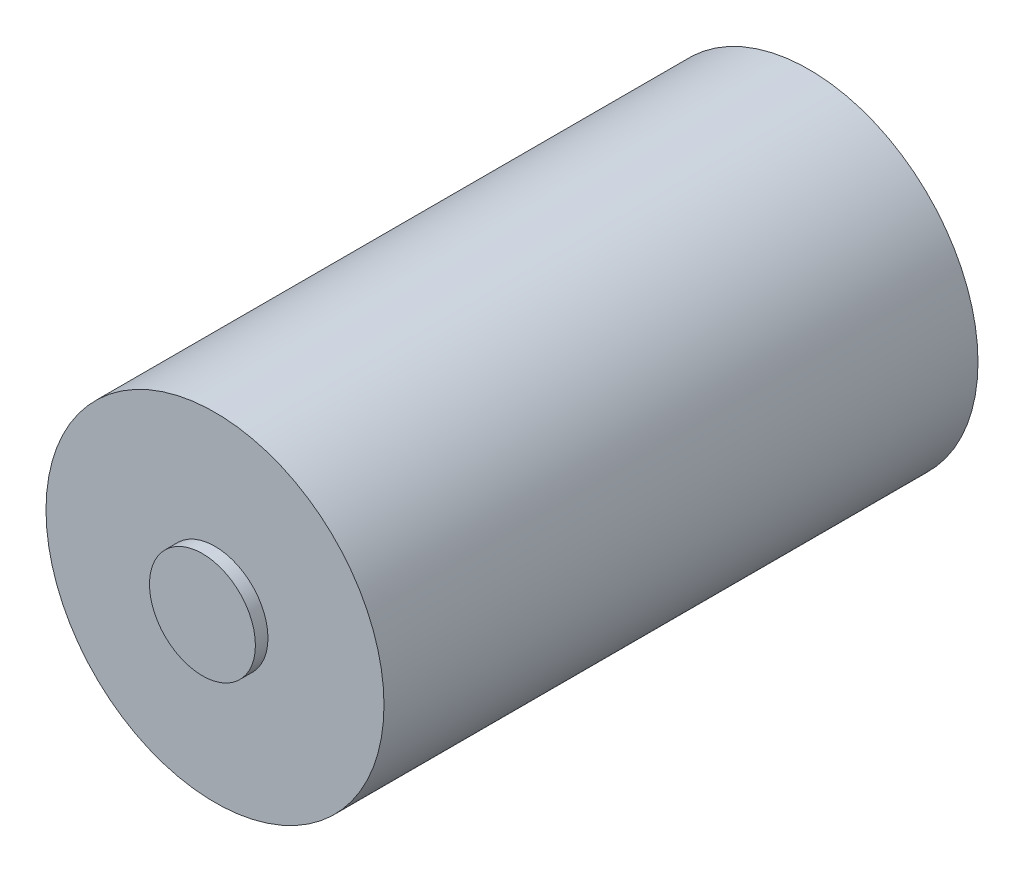
ISO-10303-21;
HEADER;
FILE_DESCRIPTION(('STEP AP214'),'2;1');
FILE_NAME('part.step','',(''),(''),'','','');
FILE_SCHEMA(('AUTOMOTIVE_DESIGN { 1 0 10303 214 1 1 1 1 }'));
ENDSEC;
DATA;
#1=APPLICATION_CONTEXT('core data for automotive mechanical design processes');
#2=APPLICATION_PROTOCOL_DEFINITION('international standard','automotive_design',2000,#1);
#3=PRODUCT_CONTEXT('',#1,'mechanical');
#4=PRODUCT('Part','Part','',(#3));
#5=PRODUCT_RELATED_PRODUCT_CATEGORY('part','',(#4));
#6=PRODUCT_DEFINITION_FORMATION('','',#4);
#7=PRODUCT_DEFINITION_CONTEXT('part definition',#1,'design');
#8=PRODUCT_DEFINITION('design','',#6,#7);
#9=PRODUCT_DEFINITION_SHAPE('','',#8);
#10=(LENGTH_UNIT() NAMED_UNIT(*) SI_UNIT(.MILLI.,.METRE.));
#11=(NAMED_UNIT(*) PLANE_ANGLE_UNIT() SI_UNIT($,.RADIAN.));
#12=(NAMED_UNIT(*) SI_UNIT($,.STERADIAN.) SOLID_ANGLE_UNIT());
#13=UNCERTAINTY_MEASURE_WITH_UNIT(LENGTH_MEASURE(1.E-05),#10,'distance_accuracy_value','');
#14=(GEOMETRIC_REPRESENTATION_CONTEXT(3) GLOBAL_UNCERTAINTY_ASSIGNED_CONTEXT((#13)) GLOBAL_UNIT_ASSIGNED_CONTEXT((#10,
#11,#12)) REPRESENTATION_CONTEXT('',''));
#15=CARTESIAN_POINT('',(0.,0.,0.));
#16=DIRECTION('',(0.,0.,1.));
#17=DIRECTION('',(1.,0.,0.));
#18=AXIS2_PLACEMENT_3D('',#15,#16,#17);
#19=CARTESIAN_POINT('',(0.,0.,1.5));
#20=DIRECTION('',(0.,0.,-1.));
#21=DIRECTION('',(-1.,0.,0.));
#22=AXIS2_PLACEMENT_3D('',#19,#20,#21);
#23=CYLINDRICAL_SURFACE('',#22,6.33);
#24=CARTESIAN_POINT('',(0.,0.,1.5));
#25=DIRECTION('',(0.,0.,1.));
#26=DIRECTION('',(1.,0.,0.));
#27=AXIS2_PLACEMENT_3D('',#24,#25,#26);
#28=CIRCLE('',#27,6.33);
#29=CARTESIAN_POINT('',(6.33,0.,1.5));
#30=VERTEX_POINT('',#29);
#31=EDGE_CURVE('E50',#30,#30,#28,.T.);
#32=ORIENTED_EDGE('',*,*,#31,.F.);
#33=EDGE_LOOP('',(#32));
#34=FACE_BOUND('',#33,.T.);
#35=CARTESIAN_POINT('',(0.,0.,0.));
#36=DIRECTION('',(0.,0.,1.));
#37=DIRECTION('',(1.,0.,0.));
#38=AXIS2_PLACEMENT_3D('',#35,#36,#37);
#39=CIRCLE('',#38,6.33);
#40=CARTESIAN_POINT('',(6.33,0.,0.));
#41=VERTEX_POINT('',#40);
#42=EDGE_CURVE('E39',#41,#41,#39,.T.);
#43=ORIENTED_EDGE('',*,*,#42,.T.);
#44=EDGE_LOOP('',(#43));
#45=FACE_BOUND('',#44,.T.);
#46=ADVANCED_FACE('F36',(#34,#45),#23,.T.);
#47=CARTESIAN_POINT('',(0.,0.,1.5));
#48=DIRECTION('',(0.,0.,1.));
#49=DIRECTION('',(1.,0.,0.));
#50=AXIS2_PLACEMENT_3D('',#47,#48,#49);
#51=PLANE('',#50);
#52=ORIENTED_EDGE('',*,*,#31,.T.);
#53=EDGE_LOOP('',(#52));
#54=FACE_BOUND('',#53,.T.);
#55=ADVANCED_FACE('F86',(#54),#51,.T.);
#56=CARTESIAN_POINT('',(0.,0.,-71.));
#57=DIRECTION('',(0.,0.,1.));
#58=DIRECTION('',(1.,0.,0.));
#59=AXIS2_PLACEMENT_3D('',#56,#57,#58);
#60=CYLINDRICAL_SURFACE('',#59,20.2);
#61=CARTESIAN_POINT('',(0.,0.,-71.));
#62=DIRECTION('',(0.,0.,1.));
#63=DIRECTION('',(1.,0.,0.));
#64=AXIS2_PLACEMENT_3D('',#61,#62,#63);
#65=CIRCLE('',#64,20.2);
#66=CARTESIAN_POINT('',(20.2,0.,-71.));
#67=VERTEX_POINT('',#66);
#68=EDGE_CURVE('E61',#67,#67,#65,.T.);
#69=ORIENTED_EDGE('',*,*,#68,.T.);
#70=EDGE_LOOP('',(#69));
#71=FACE_BOUND('',#70,.T.);
#72=CARTESIAN_POINT('',(0.,0.,0.));
#73=DIRECTION('',(0.,0.,1.));
#74=DIRECTION('',(1.,0.,0.));
#75=AXIS2_PLACEMENT_3D('',#72,#73,#74);
#76=CIRCLE('',#75,20.2);
#77=CARTESIAN_POINT('',(20.2,0.,0.));
#78=VERTEX_POINT('',#77);
#79=EDGE_CURVE('E59',#78,#78,#76,.T.);
#80=ORIENTED_EDGE('',*,*,#79,.F.);
#81=EDGE_LOOP('',(#80));
#82=FACE_BOUND('',#81,.T.);
#83=ADVANCED_FACE('F84',(#71,#82),#60,.T.);
#84=CARTESIAN_POINT('',(0.,0.,-71.));
#85=DIRECTION('',(0.,0.,1.));
#86=DIRECTION('',(1.,0.,0.));
#87=AXIS2_PLACEMENT_3D('',#84,#85,#86);
#88=PLANE('',#87);
#89=CARTESIAN_POINT('',(12.5,0.,-71.));
#90=DIRECTION('',(0.,0.,-1.));
#91=DIRECTION('',(-1.,0.,0.));
#92=AXIS2_PLACEMENT_3D('',#89,#90,#91);
#93=CIRCLE('',#92,1.65);
#94=CARTESIAN_POINT('',(10.85,0.,-71.));
#95=VERTEX_POINT('',#94);
#96=EDGE_CURVE('E204',#95,#95,#93,.T.);
#97=ORIENTED_EDGE('',*,*,#96,.F.);
#98=EDGE_LOOP('',(#97));
#99=FACE_BOUND('',#98,.T.);
#100=CARTESIAN_POINT('',(-12.5,0.,-71.));
#101=DIRECTION('',(0.,0.,-1.));
#102=DIRECTION('',(1.,0.,0.));
#103=AXIS2_PLACEMENT_3D('',#100,#101,#102);
#104=CIRCLE('',#103,1.65);
#105=CARTESIAN_POINT('',(-10.85,0.,-71.));
#106=VERTEX_POINT('',#105);
#107=EDGE_CURVE('E215',#106,#106,#104,.T.);
#108=ORIENTED_EDGE('',*,*,#107,.F.);
#109=EDGE_LOOP('',(#108));
#110=FACE_BOUND('',#109,.T.);
#111=CARTESIAN_POINT('',(0.,0.,-71.));
#112=DIRECTION('',(0.,0.,-1.));
#113=DIRECTION('',(-1.,0.,0.));
#114=AXIS2_PLACEMENT_3D('',#111,#112,#113);
#115=CIRCLE('',#114,6.);
#116=CARTESIAN_POINT('',(-6.,0.,-71.));
#117=VERTEX_POINT('',#116);
#118=EDGE_CURVE('E44',#117,#117,#115,.T.);
#119=ORIENTED_EDGE('',*,*,#118,.F.);
#120=EDGE_LOOP('',(#119));
#121=FACE_BOUND('',#120,.T.);
#122=ORIENTED_EDGE('',*,*,#68,.F.);
#123=EDGE_LOOP('',(#122));
#124=FACE_BOUND('',#123,.T.);
#125=ADVANCED_FACE('F80',(#99,#110,#121,#124),#88,.F.);
#126=CARTESIAN_POINT('',(0.,0.,0.));
#127=DIRECTION('',(0.,0.,1.));
#128=DIRECTION('',(1.,0.,0.));
#129=AXIS2_PLACEMENT_3D('',#126,#127,#128);
#130=PLANE('',#129);
#131=ORIENTED_EDGE('',*,*,#42,.F.);
#132=EDGE_LOOP('',(#131));
#133=FACE_BOUND('',#132,.T.);
#134=ORIENTED_EDGE('',*,*,#79,.T.);
#135=EDGE_LOOP('',(#134));
#136=FACE_BOUND('',#135,.T.);
#137=ADVANCED_FACE('F76',(#133,#136),#130,.T.);
#138=CARTESIAN_POINT('',(0.,0.,-74.));
#139=DIRECTION('',(0.,0.,1.));
#140=DIRECTION('',(1.,0.,0.));
#141=AXIS2_PLACEMENT_3D('',#138,#139,#140);
#142=CYLINDRICAL_SURFACE('',#141,6.);
#143=CARTESIAN_POINT('',(0.,0.,-74.));
#144=DIRECTION('',(0.,0.,-1.));
#145=DIRECTION('',(-1.,0.,0.));
#146=AXIS2_PLACEMENT_3D('',#143,#144,#145);
#147=CIRCLE('',#146,6.);
#148=CARTESIAN_POINT('',(-6.,0.,-74.));
#149=VERTEX_POINT('',#148);
#150=EDGE_CURVE('E56',#149,#149,#147,.T.);
#151=ORIENTED_EDGE('',*,*,#150,.F.);
#152=EDGE_LOOP('',(#151));
#153=FACE_BOUND('',#152,.T.);
#154=ORIENTED_EDGE('',*,*,#118,.T.);
#155=EDGE_LOOP('',(#154));
#156=FACE_BOUND('',#155,.T.);
#157=ADVANCED_FACE('F79',(#153,#156),#142,.T.);
#158=CARTESIAN_POINT('',(0.,0.,-74.));
#159=DIRECTION('',(0.,0.,-1.));
#160=DIRECTION('',(-1.,0.,0.));
#161=AXIS2_PLACEMENT_3D('',#158,#159,#160);
#162=PLANE('',#161);
#163=CARTESIAN_POINT('',(0.,0.,-74.));
#164=DIRECTION('',(0.,0.,-1.));
#165=DIRECTION('',(-1.,0.,0.));
#166=AXIS2_PLACEMENT_3D('',#163,#164,#165);
#167=CIRCLE('',#166,2.);
#168=CARTESIAN_POINT('',(-2.,0.,-74.));
#169=VERTEX_POINT('',#168);
#170=EDGE_CURVE('E10',#169,#169,#167,.T.);
#171=ORIENTED_EDGE('',*,*,#170,.F.);
#172=EDGE_LOOP('',(#171));
#173=FACE_BOUND('',#172,.T.);
#174=ORIENTED_EDGE('',*,*,#150,.T.);
#175=EDGE_LOOP('',(#174));
#176=FACE_BOUND('',#175,.T.);
#177=ADVANCED_FACE('F124',(#173,#176),#162,.T.);
#178=CARTESIAN_POINT('',(0.,0.,-83.));
#179=DIRECTION('',(0.,0.,1.));
#180=DIRECTION('',(1.,0.,0.));
#181=AXIS2_PLACEMENT_3D('',#178,#179,#180);
#182=CYLINDRICAL_SURFACE('',#181,2.);
#183=CARTESIAN_POINT('',(0.,0.,-83.));
#184=DIRECTION('',(0.,0.,-1.));
#185=DIRECTION('',(-1.,0.,0.));
#186=AXIS2_PLACEMENT_3D('',#183,#184,#185);
#187=CIRCLE('',#186,2.);
#188=CARTESIAN_POINT('',(-2.,0.,-83.));
#189=VERTEX_POINT('',#188);
#190=EDGE_CURVE('E54',#189,#189,#187,.T.);
#191=ORIENTED_EDGE('',*,*,#190,.F.);
#192=EDGE_LOOP('',(#191));
#193=FACE_BOUND('',#192,.T.);
#194=ORIENTED_EDGE('',*,*,#170,.T.);
#195=EDGE_LOOP('',(#194));
#196=FACE_BOUND('',#195,.T.);
#197=ADVANCED_FACE('F134',(#193,#196),#182,.T.);
#198=CARTESIAN_POINT('',(0.,0.,-83.));
#199=DIRECTION('',(0.,0.,-1.));
#200=DIRECTION('',(-1.,0.,0.));
#201=AXIS2_PLACEMENT_3D('',#198,#199,#200);
#202=PLANE('',#201);
#203=ORIENTED_EDGE('',*,*,#190,.T.);
#204=EDGE_LOOP('',(#203));
#205=FACE_BOUND('',#204,.T.);
#206=ADVANCED_FACE('F144',(#205),#202,.T.);
#207=CARTESIAN_POINT('',(-12.5,0.,-67.));
#208=DIRECTION('',(0.,0.,-1.));
#209=DIRECTION('',(-1.,0.,0.));
#210=AXIS2_PLACEMENT_3D('',#207,#208,#209);
#211=CYLINDRICAL_SURFACE('',#210,1.65);
#212=CARTESIAN_POINT('',(-12.5,0.,-67.));
#213=DIRECTION('',(0.,0.,-1.));
#214=DIRECTION('',(1.,0.,0.));
#215=AXIS2_PLACEMENT_3D('',#212,#213,#214);
#216=CIRCLE('',#215,1.65);
#217=CARTESIAN_POINT('',(-10.85,0.,-67.));
#218=VERTEX_POINT('',#217);
#219=EDGE_CURVE('E210',#218,#218,#216,.T.);
#220=ORIENTED_EDGE('',*,*,#219,.F.);
#221=EDGE_LOOP('',(#220));
#222=FACE_BOUND('',#221,.T.);
#223=ORIENTED_EDGE('',*,*,#107,.T.);
#224=EDGE_LOOP('',(#223));
#225=FACE_BOUND('',#224,.T.);
#226=ADVANCED_FACE('F153',(#222,#225),#211,.F.);
#227=CARTESIAN_POINT('',(-12.5,0.,-67.));
#228=DIRECTION('',(0.,0.,1.));
#229=DIRECTION('',(1.,0.,0.));
#230=AXIS2_PLACEMENT_3D('',#227,#228,#229);
#231=PLANE('',#230);
#232=ORIENTED_EDGE('',*,*,#219,.T.);
#233=EDGE_LOOP('',(#232));
#234=FACE_BOUND('',#233,.T.);
#235=ADVANCED_FACE('F166',(#234),#231,.F.);
#236=CARTESIAN_POINT('',(12.5,0.,-67.));
#237=DIRECTION('',(0.,0.,-1.));
#238=DIRECTION('',(-1.,0.,0.));
#239=AXIS2_PLACEMENT_3D('',#236,#237,#238);
#240=CYLINDRICAL_SURFACE('',#239,1.65);
#241=CARTESIAN_POINT('',(12.5,0.,-67.));
#242=DIRECTION('',(0.,0.,-1.));
#243=DIRECTION('',(-1.,0.,0.));
#244=AXIS2_PLACEMENT_3D('',#241,#242,#243);
#245=CIRCLE('',#244,1.65);
#246=CARTESIAN_POINT('',(10.85,0.,-67.));
#247=VERTEX_POINT('',#246);
#248=EDGE_CURVE('E202',#247,#247,#245,.T.);
#249=ORIENTED_EDGE('',*,*,#248,.F.);
#250=EDGE_LOOP('',(#249));
#251=FACE_BOUND('',#250,.T.);
#252=ORIENTED_EDGE('',*,*,#96,.T.);
#253=EDGE_LOOP('',(#252));
#254=FACE_BOUND('',#253,.T.);
#255=ADVANCED_FACE('F176',(#251,#254),#240,.F.);
#256=CARTESIAN_POINT('',(12.5,0.,-67.));
#257=DIRECTION('',(0.,0.,-1.));
#258=DIRECTION('',(-1.,0.,0.));
#259=AXIS2_PLACEMENT_3D('',#256,#257,#258);
#260=PLANE('',#259);
#261=ORIENTED_EDGE('',*,*,#248,.T.);
#262=EDGE_LOOP('',(#261));
#263=FACE_BOUND('',#262,.T.);
#264=ADVANCED_FACE('F186',(#263),#260,.T.);
#265=CLOSED_SHELL('',(#46,#55,#83,#125,#137,#157,#177,#197,#206,#226,#235,#255,#264));
#266=MANIFOLD_SOLID_BREP('B2',#265);
#267=ADVANCED_BREP_SHAPE_REPRESENTATION('',(#18,#266),#14);
#268=SHAPE_DEFINITION_REPRESENTATION(#9,#267);
ENDSEC;
END-ISO-10303-21;
